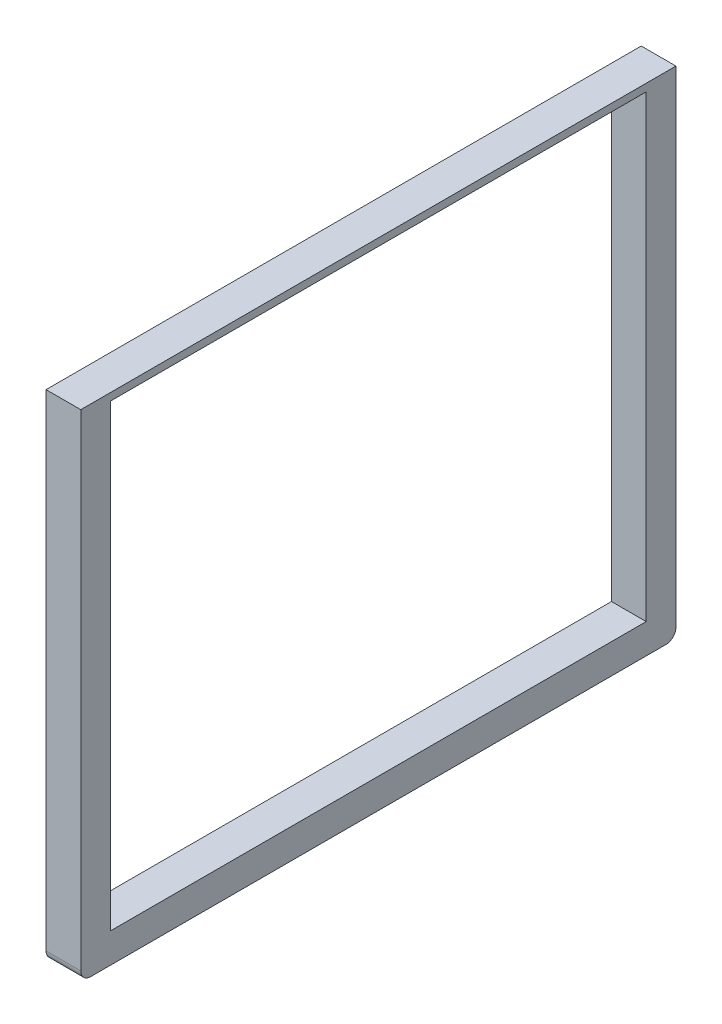
ISO-10303-21;
HEADER;
FILE_DESCRIPTION(('STEP AP214'),'2;1');
FILE_NAME('part.step','',(''),(''),'','','');
FILE_SCHEMA(('AUTOMOTIVE_DESIGN { 1 0 10303 214 1 1 1 1 }'));
ENDSEC;
DATA;
#1=APPLICATION_CONTEXT('core data for automotive mechanical design processes');
#2=APPLICATION_PROTOCOL_DEFINITION('international standard','automotive_design',2000,#1);
#3=PRODUCT_CONTEXT('',#1,'mechanical');
#4=PRODUCT('Part','Part','',(#3));
#5=PRODUCT_RELATED_PRODUCT_CATEGORY('part','',(#4));
#6=PRODUCT_DEFINITION_FORMATION('','',#4);
#7=PRODUCT_DEFINITION_CONTEXT('part definition',#1,'design');
#8=PRODUCT_DEFINITION('design','',#6,#7);
#9=PRODUCT_DEFINITION_SHAPE('','',#8);
#10=(LENGTH_UNIT() NAMED_UNIT(*) SI_UNIT(.MILLI.,.METRE.));
#11=(NAMED_UNIT(*) PLANE_ANGLE_UNIT() SI_UNIT($,.RADIAN.));
#12=(NAMED_UNIT(*) SI_UNIT($,.STERADIAN.) SOLID_ANGLE_UNIT());
#13=UNCERTAINTY_MEASURE_WITH_UNIT(LENGTH_MEASURE(1.E-05),#10,'distance_accuracy_value','');
#14=(GEOMETRIC_REPRESENTATION_CONTEXT(3) GLOBAL_UNCERTAINTY_ASSIGNED_CONTEXT((#13)) GLOBAL_UNIT_ASSIGNED_CONTEXT((#10,
#11,#12)) REPRESENTATION_CONTEXT('',''));
#15=CARTESIAN_POINT('',(0.,0.,0.));
#16=DIRECTION('',(0.,0.,1.));
#17=DIRECTION('',(1.,0.,0.));
#18=AXIS2_PLACEMENT_3D('',#15,#16,#17);
#19=CARTESIAN_POINT('',(35.,250.,-289.501486325075));
#20=DIRECTION('',(0.,-5.86068712005172E-07,0.999999999999828));
#21=DIRECTION('',(0.,-0.999999999999828,-5.86068712005172E-07));
#22=AXIS2_PLACEMENT_3D('',#19,#20,#21);
#23=PLANE('',#22);
#24=DIRECTION('',(0.,0.999999999999828,5.86068712005172E-07));
#25=VECTOR('',#24,1.);
#26=CARTESIAN_POINT('',(35.,250.,-289.501486325075));
#27=LINE('',#26,#25);
#28=CARTESIAN_POINT('',(35.,-239.999994139229,-289.50177349874));
#29=VERTEX_POINT('',#28);
#30=CARTESIAN_POINT('',(35.,250.,-289.501486325075));
#31=VERTEX_POINT('',#30);
#32=EDGE_CURVE('E181',#29,#31,#27,.T.);
#33=ORIENTED_EDGE('',*,*,#32,.F.);
#34=DIRECTION('',(-1.,0.,0.));
#35=VECTOR('',#34,1.);
#36=CARTESIAN_POINT('',(35.,-239.999994139228,-289.50177349874));
#37=LINE('',#36,#35);
#38=CARTESIAN_POINT('',(0.,-239.999994139229,-289.50177349874));
#39=VERTEX_POINT('',#38);
#40=EDGE_CURVE('E212',#29,#39,#37,.T.);
#41=ORIENTED_EDGE('',*,*,#40,.T.);
#42=DIRECTION('',(0.,0.999999999999828,5.86068712005172E-07));
#43=VECTOR('',#42,1.);
#44=CARTESIAN_POINT('',(0.,250.,-289.501486325075));
#45=LINE('',#44,#43);
#46=CARTESIAN_POINT('',(0.,250.,-289.501486325075));
#47=VERTEX_POINT('',#46);
#48=EDGE_CURVE('E175',#39,#47,#45,.T.);
#49=ORIENTED_EDGE('',*,*,#48,.T.);
#50=DIRECTION('',(-1.,0.,0.));
#51=VECTOR('',#50,1.);
#52=CARTESIAN_POINT('',(35.,250.,-289.501486325075));
#53=LINE('',#52,#51);
#54=EDGE_CURVE('E208',#31,#47,#53,.T.);
#55=ORIENTED_EDGE('',*,*,#54,.F.);
#56=EDGE_LOOP('',(#33,#41,#49,#55));
#57=FACE_BOUND('',#56,.T.);
#58=ADVANCED_FACE('F45',(#57),#23,.F.);
#59=CARTESIAN_POINT('',(35.,250.,310.498220640569));
#60=DIRECTION('',(0.,-1.,0.));
#61=DIRECTION('',(0.,0.,-1.));
#62=AXIS2_PLACEMENT_3D('',#59,#60,#61);
#63=PLANE('',#62);
#64=DIRECTION('',(0.,0.,1.));
#65=VECTOR('',#64,1.);
#66=CARTESIAN_POINT('',(0.,250.,310.498220640569));
#67=LINE('',#66,#65);
#68=CARTESIAN_POINT('',(0.,250.,310.498220640569));
#69=VERTEX_POINT('',#68);
#70=EDGE_CURVE('E197',#47,#69,#67,.T.);
#71=ORIENTED_EDGE('',*,*,#70,.T.);
#72=DIRECTION('',(-1.,0.,0.));
#73=VECTOR('',#72,1.);
#74=CARTESIAN_POINT('',(35.,250.,310.498220640569));
#75=LINE('',#74,#73);
#76=CARTESIAN_POINT('',(35.,250.,310.498220640569));
#77=VERTEX_POINT('',#76);
#78=EDGE_CURVE('E194',#77,#69,#75,.T.);
#79=ORIENTED_EDGE('',*,*,#78,.F.);
#80=DIRECTION('',(0.,0.,1.));
#81=VECTOR('',#80,1.);
#82=CARTESIAN_POINT('',(35.,250.,310.498220640569));
#83=LINE('',#82,#81);
#84=EDGE_CURVE('E184',#31,#77,#83,.T.);
#85=ORIENTED_EDGE('',*,*,#84,.F.);
#86=ORIENTED_EDGE('',*,*,#54,.T.);
#87=EDGE_LOOP('',(#71,#79,#85,#86));
#88=FACE_BOUND('',#87,.T.);
#89=ADVANCED_FACE('F252',(#88),#63,.F.);
#90=CARTESIAN_POINT('',(35.,250.,310.498220640569));
#91=DIRECTION('',(0.,0.,-1.));
#92=DIRECTION('',(-1.,0.,0.));
#93=AXIS2_PLACEMENT_3D('',#90,#91,#92);
#94=PLANE('',#93);
#95=DIRECTION('',(0.,-1.,0.));
#96=VECTOR('',#95,1.);
#97=CARTESIAN_POINT('',(0.,250.,310.498220640569));
#98=LINE('',#97,#96);
#99=CARTESIAN_POINT('',(0.,-239.999999999999,310.498220640569));
#100=VERTEX_POINT('',#99);
#101=EDGE_CURVE('E200',#69,#100,#98,.T.);
#102=ORIENTED_EDGE('',*,*,#101,.T.);
#103=DIRECTION('',(-1.,0.,0.));
#104=VECTOR('',#103,1.);
#105=CARTESIAN_POINT('',(35.,-239.999999999999,310.498220640569));
#106=LINE('',#105,#104);
#107=CARTESIAN_POINT('',(35.,-239.999999999999,310.498220640569));
#108=VERTEX_POINT('',#107);
#109=EDGE_CURVE('E11',#100,#108,#106,.F.);
#110=ORIENTED_EDGE('',*,*,#109,.T.);
#111=DIRECTION('',(0.,-1.,0.));
#112=VECTOR('',#111,1.);
#113=CARTESIAN_POINT('',(35.,250.,310.498220640569));
#114=LINE('',#113,#112);
#115=EDGE_CURVE('E188',#77,#108,#114,.T.);
#116=ORIENTED_EDGE('',*,*,#115,.F.);
#117=ORIENTED_EDGE('',*,*,#78,.T.);
#118=EDGE_LOOP('',(#102,#110,#116,#117));
#119=FACE_BOUND('',#118,.T.);
#120=ADVANCED_FACE('F249',(#119),#94,.F.);
#121=CARTESIAN_POINT('',(35.,-250.,310.498220640569));
#122=DIRECTION('',(0.,1.,1.43033733005874E-13));
#123=DIRECTION('',(0.,-1.43033733005874E-13,1.));
#124=AXIS2_PLACEMENT_3D('',#121,#122,#123);
#125=PLANE('',#124);
#126=DIRECTION('',(0.,1.43033733005874E-13,-1.));
#127=VECTOR('',#126,1.);
#128=CARTESIAN_POINT('',(0.,-250.,310.498220640569));
#129=LINE('',#128,#127);
#130=CARTESIAN_POINT('',(0.,-249.999999999999,300.498220640568));
#131=VERTEX_POINT('',#130);
#132=CARTESIAN_POINT('',(0.,-249.999999999916,-279.501773498743));
#133=VERTEX_POINT('',#132);
#134=EDGE_CURVE('E185',#131,#133,#129,.T.);
#135=ORIENTED_EDGE('',*,*,#134,.T.);
#136=DIRECTION('',(-1.,0.,0.));
#137=VECTOR('',#136,1.);
#138=CARTESIAN_POINT('',(35.,-249.999999999916,-279.501773498743));
#139=LINE('',#138,#137);
#140=CARTESIAN_POINT('',(35.,-249.999999999916,-279.501773498743));
#141=VERTEX_POINT('',#140);
#142=EDGE_CURVE('E67',#133,#141,#139,.F.);
#143=ORIENTED_EDGE('',*,*,#142,.T.);
#144=DIRECTION('',(0.,1.43033733005874E-13,-1.));
#145=VECTOR('',#144,1.);
#146=CARTESIAN_POINT('',(35.,-250.,310.498220640569));
#147=LINE('',#146,#145);
#148=CARTESIAN_POINT('',(35.,-249.999999999999,300.498220640568));
#149=VERTEX_POINT('',#148);
#150=EDGE_CURVE('E191',#149,#141,#147,.T.);
#151=ORIENTED_EDGE('',*,*,#150,.F.);
#152=DIRECTION('',(-1.,0.,0.));
#153=VECTOR('',#152,1.);
#154=CARTESIAN_POINT('',(35.,-249.999999999999,300.498220640568));
#155=LINE('',#154,#153);
#156=EDGE_CURVE('E222',#149,#131,#155,.T.);
#157=ORIENTED_EDGE('',*,*,#156,.T.);
#158=EDGE_LOOP('',(#135,#143,#151,#157));
#159=FACE_BOUND('',#158,.T.);
#160=ADVANCED_FACE('F244',(#159),#125,.F.);
#161=CARTESIAN_POINT('',(35.,0.,0.));
#162=DIRECTION('',(1.,0.,0.));
#163=DIRECTION('',(0.,0.,-1.));
#164=AXIS2_PLACEMENT_3D('',#161,#162,#163);
#165=PLANE('',#164);
#166=DIRECTION('',(0.,1.,0.));
#167=VECTOR('',#166,1.);
#168=CARTESIAN_POINT('',(35.,-220.,-259.501490720585));
#169=LINE('',#168,#167);
#170=CARTESIAN_POINT('',(35.,-220.,-259.501490720585));
#171=VERTEX_POINT('',#170);
#172=CARTESIAN_POINT('',(35.,242.5,-259.501490720585));
#173=VERTEX_POINT('',#172);
#174=EDGE_CURVE('E132',#171,#173,#169,.T.);
#175=ORIENTED_EDGE('',*,*,#174,.F.);
#176=DIRECTION('',(0.,0.,-1.));
#177=VECTOR('',#176,1.);
#178=CARTESIAN_POINT('',(35.,-220.,280.498220640569));
#179=LINE('',#178,#177);
#180=CARTESIAN_POINT('',(35.,-220.,280.498220640569));
#181=VERTEX_POINT('',#180);
#182=EDGE_CURVE('E153',#181,#171,#179,.T.);
#183=ORIENTED_EDGE('',*,*,#182,.F.);
#184=DIRECTION('',(0.,-1.,0.));
#185=VECTOR('',#184,1.);
#186=CARTESIAN_POINT('',(35.,242.5,280.498220640569));
#187=LINE('',#186,#185);
#188=CARTESIAN_POINT('',(35.,242.5,280.498220640569));
#189=VERTEX_POINT('',#188);
#190=EDGE_CURVE('E157',#189,#181,#187,.T.);
#191=ORIENTED_EDGE('',*,*,#190,.F.);
#192=DIRECTION('',(0.,0.,1.));
#193=VECTOR('',#192,1.);
#194=CARTESIAN_POINT('',(35.,242.5,280.498220640569));
#195=LINE('',#194,#193);
#196=EDGE_CURVE('E166',#173,#189,#195,.T.);
#197=ORIENTED_EDGE('',*,*,#196,.F.);
#198=EDGE_LOOP('',(#175,#183,#191,#197));
#199=FACE_BOUND('',#198,.T.);
#200=ORIENTED_EDGE('',*,*,#150,.T.);
#201=CARTESIAN_POINT('',(35.,-239.999999999916,-279.501773498742));
#202=DIRECTION('',(1.,0.,0.));
#203=DIRECTION('',(0.,0.,-1.));
#204=AXIS2_PLACEMENT_3D('',#201,#202,#203);
#205=CIRCLE('',#204,10.);
#206=EDGE_CURVE('E54',#141,#29,#205,.T.);
#207=ORIENTED_EDGE('',*,*,#206,.T.);
#208=ORIENTED_EDGE('',*,*,#32,.T.);
#209=ORIENTED_EDGE('',*,*,#84,.T.);
#210=ORIENTED_EDGE('',*,*,#115,.T.);
#211=CARTESIAN_POINT('',(35.,-239.999999999999,300.498220640569));
#212=DIRECTION('',(1.,0.,0.));
#213=DIRECTION('',(0.,0.,-1.));
#214=AXIS2_PLACEMENT_3D('',#211,#212,#213);
#215=CIRCLE('',#214,10.);
#216=EDGE_CURVE('E228',#108,#149,#215,.T.);
#217=ORIENTED_EDGE('',*,*,#216,.T.);
#218=EDGE_LOOP('',(#200,#207,#208,#209,#210,#217));
#219=FACE_BOUND('',#218,.T.);
#220=ADVANCED_FACE('F234',(#199,#219),#165,.T.);
#221=CARTESIAN_POINT('',(0.,0.,0.));
#222=DIRECTION('',(1.,0.,0.));
#223=DIRECTION('',(0.,0.,-1.));
#224=AXIS2_PLACEMENT_3D('',#221,#222,#223);
#225=PLANE('',#224);
#226=DIRECTION('',(0.,0.,-1.));
#227=VECTOR('',#226,1.);
#228=CARTESIAN_POINT('',(0.,-220.,280.498220640569));
#229=LINE('',#228,#227);
#230=CARTESIAN_POINT('',(0.,-220.,280.498220640569));
#231=VERTEX_POINT('',#230);
#232=CARTESIAN_POINT('',(0.,-220.,-259.501490720585));
#233=VERTEX_POINT('',#232);
#234=EDGE_CURVE('E138',#231,#233,#229,.T.);
#235=ORIENTED_EDGE('',*,*,#234,.T.);
#236=DIRECTION('',(0.,1.,0.));
#237=VECTOR('',#236,1.);
#238=CARTESIAN_POINT('',(0.,-220.,-259.501490720585));
#239=LINE('',#238,#237);
#240=CARTESIAN_POINT('',(0.,242.5,-259.501490720585));
#241=VERTEX_POINT('',#240);
#242=EDGE_CURVE('E129',#233,#241,#239,.T.);
#243=ORIENTED_EDGE('',*,*,#242,.T.);
#244=DIRECTION('',(0.,0.,1.));
#245=VECTOR('',#244,1.);
#246=CARTESIAN_POINT('',(0.,242.5,280.498220640569));
#247=LINE('',#246,#245);
#248=CARTESIAN_POINT('',(0.,242.5,280.498220640569));
#249=VERTEX_POINT('',#248);
#250=EDGE_CURVE('E142',#241,#249,#247,.T.);
#251=ORIENTED_EDGE('',*,*,#250,.T.);
#252=DIRECTION('',(0.,-1.,0.));
#253=VECTOR('',#252,1.);
#254=CARTESIAN_POINT('',(0.,242.5,280.498220640569));
#255=LINE('',#254,#253);
#256=EDGE_CURVE('E147',#249,#231,#255,.T.);
#257=ORIENTED_EDGE('',*,*,#256,.T.);
#258=EDGE_LOOP('',(#235,#243,#251,#257));
#259=FACE_BOUND('',#258,.T.);
#260=ORIENTED_EDGE('',*,*,#48,.F.);
#261=CARTESIAN_POINT('',(0.,-239.999999999916,-279.501773498742));
#262=DIRECTION('',(1.,0.,0.));
#263=DIRECTION('',(0.,0.,-1.));
#264=AXIS2_PLACEMENT_3D('',#261,#262,#263);
#265=CIRCLE('',#264,10.);
#266=EDGE_CURVE('E219',#39,#133,#265,.F.);
#267=ORIENTED_EDGE('',*,*,#266,.T.);
#268=ORIENTED_EDGE('',*,*,#134,.F.);
#269=CARTESIAN_POINT('',(0.,-239.999999999999,300.498220640569));
#270=DIRECTION('',(1.,0.,0.));
#271=DIRECTION('',(0.,0.,-1.));
#272=AXIS2_PLACEMENT_3D('',#269,#270,#271);
#273=CIRCLE('',#272,10.);
#274=EDGE_CURVE('E216',#131,#100,#273,.F.);
#275=ORIENTED_EDGE('',*,*,#274,.T.);
#276=ORIENTED_EDGE('',*,*,#101,.F.);
#277=ORIENTED_EDGE('',*,*,#70,.F.);
#278=EDGE_LOOP('',(#260,#267,#268,#275,#276,#277));
#279=FACE_BOUND('',#278,.T.);
#280=ADVANCED_FACE('F149',(#259,#279),#225,.F.);
#281=CARTESIAN_POINT('',(0.,-220.,-259.501490720585));
#282=DIRECTION('',(0.,0.,-1.));
#283=DIRECTION('',(-1.,0.,0.));
#284=AXIS2_PLACEMENT_3D('',#281,#282,#283);
#285=PLANE('',#284);
#286=ORIENTED_EDGE('',*,*,#174,.T.);
#287=DIRECTION('',(1.,0.,0.));
#288=VECTOR('',#287,1.);
#289=CARTESIAN_POINT('',(0.,242.5,-259.501490720585));
#290=LINE('',#289,#288);
#291=EDGE_CURVE('E125',#241,#173,#290,.T.);
#292=ORIENTED_EDGE('',*,*,#291,.F.);
#293=ORIENTED_EDGE('',*,*,#242,.F.);
#294=DIRECTION('',(1.,0.,0.));
#295=VECTOR('',#294,1.);
#296=CARTESIAN_POINT('',(0.,-220.,-259.501490720585));
#297=LINE('',#296,#295);
#298=EDGE_CURVE('E172',#233,#171,#297,.T.);
#299=ORIENTED_EDGE('',*,*,#298,.T.);
#300=EDGE_LOOP('',(#286,#292,#293,#299));
#301=FACE_BOUND('',#300,.T.);
#302=ADVANCED_FACE('F127',(#301),#285,.F.);
#303=CARTESIAN_POINT('',(0.,-220.,280.498220640569));
#304=DIRECTION('',(0.,-1.,0.));
#305=DIRECTION('',(0.,0.,-1.));
#306=AXIS2_PLACEMENT_3D('',#303,#304,#305);
#307=PLANE('',#306);
#308=ORIENTED_EDGE('',*,*,#182,.T.);
#309=ORIENTED_EDGE('',*,*,#298,.F.);
#310=ORIENTED_EDGE('',*,*,#234,.F.);
#311=DIRECTION('',(1.,0.,0.));
#312=VECTOR('',#311,1.);
#313=CARTESIAN_POINT('',(0.,-220.,280.498220640569));
#314=LINE('',#313,#312);
#315=EDGE_CURVE('E176',#231,#181,#314,.T.);
#316=ORIENTED_EDGE('',*,*,#315,.T.);
#317=EDGE_LOOP('',(#308,#309,#310,#316));
#318=FACE_BOUND('',#317,.T.);
#319=ADVANCED_FACE('F272',(#318),#307,.F.);
#320=CARTESIAN_POINT('',(0.,242.5,280.498220640569));
#321=DIRECTION('',(0.,0.,1.));
#322=DIRECTION('',(1.,0.,0.));
#323=AXIS2_PLACEMENT_3D('',#320,#321,#322);
#324=PLANE('',#323);
#325=ORIENTED_EDGE('',*,*,#190,.T.);
#326=ORIENTED_EDGE('',*,*,#315,.F.);
#327=ORIENTED_EDGE('',*,*,#256,.F.);
#328=DIRECTION('',(1.,0.,0.));
#329=VECTOR('',#328,1.);
#330=CARTESIAN_POINT('',(0.,242.5,280.498220640569));
#331=LINE('',#330,#329);
#332=EDGE_CURVE('E137',#249,#189,#331,.T.);
#333=ORIENTED_EDGE('',*,*,#332,.T.);
#334=EDGE_LOOP('',(#325,#326,#327,#333));
#335=FACE_BOUND('',#334,.T.);
#336=ADVANCED_FACE('F267',(#335),#324,.F.);
#337=CARTESIAN_POINT('',(0.,242.5,280.498220640569));
#338=DIRECTION('',(0.,1.,0.));
#339=DIRECTION('',(0.,0.,1.));
#340=AXIS2_PLACEMENT_3D('',#337,#338,#339);
#341=PLANE('',#340);
#342=ORIENTED_EDGE('',*,*,#196,.T.);
#343=ORIENTED_EDGE('',*,*,#332,.F.);
#344=ORIENTED_EDGE('',*,*,#250,.F.);
#345=ORIENTED_EDGE('',*,*,#291,.T.);
#346=EDGE_LOOP('',(#342,#343,#344,#345));
#347=FACE_BOUND('',#346,.T.);
#348=ADVANCED_FACE('F143',(#347),#341,.F.);
#349=CARTESIAN_POINT('',(35.,-239.999999999916,-279.501773498742));
#350=DIRECTION('',(-1.,0.,0.));
#351=DIRECTION('',(0.,0.,1.));
#352=AXIS2_PLACEMENT_3D('',#349,#350,#351);
#353=CYLINDRICAL_SURFACE('',#352,10.);
#354=ORIENTED_EDGE('',*,*,#206,.F.);
#355=ORIENTED_EDGE('',*,*,#142,.F.);
#356=ORIENTED_EDGE('',*,*,#266,.F.);
#357=ORIENTED_EDGE('',*,*,#40,.F.);
#358=EDGE_LOOP('',(#354,#355,#356,#357));
#359=FACE_BOUND('',#358,.T.);
#360=ADVANCED_FACE('F241',(#359),#353,.T.);
#361=CARTESIAN_POINT('',(35.,-239.999999999999,300.498220640569));
#362=DIRECTION('',(-1.,0.,0.));
#363=DIRECTION('',(0.,0.,1.));
#364=AXIS2_PLACEMENT_3D('',#361,#362,#363);
#365=CYLINDRICAL_SURFACE('',#364,10.);
#366=ORIENTED_EDGE('',*,*,#216,.F.);
#367=ORIENTED_EDGE('',*,*,#109,.F.);
#368=ORIENTED_EDGE('',*,*,#274,.F.);
#369=ORIENTED_EDGE('',*,*,#156,.F.);
#370=EDGE_LOOP('',(#366,#367,#368,#369));
#371=FACE_BOUND('',#370,.T.);
#372=ADVANCED_FACE('F47',(#371),#365,.T.);
#373=CLOSED_SHELL('',(#58,#89,#120,#160,#220,#280,#302,#319,#336,#348,#360,#372));
#374=MANIFOLD_SOLID_BREP('B2',#373);
#375=ADVANCED_BREP_SHAPE_REPRESENTATION('',(#18,#374),#14);
#376=SHAPE_DEFINITION_REPRESENTATION(#9,#375);
ENDSEC;
END-ISO-10303-21;
